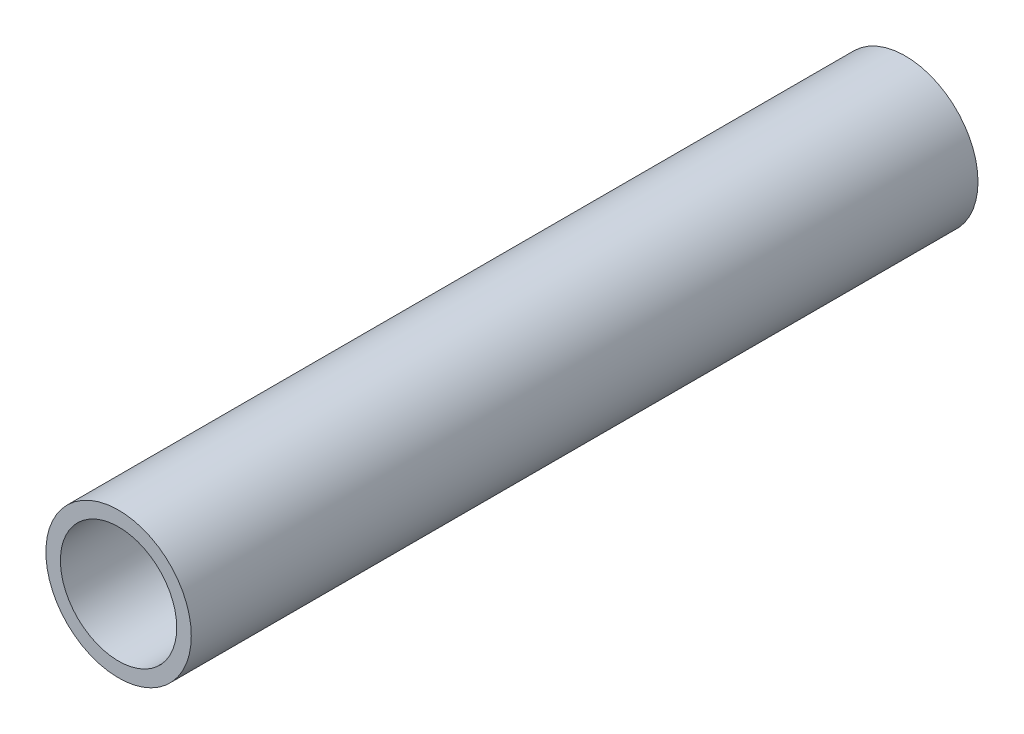
ISO-10303-21;
HEADER;
FILE_DESCRIPTION(('STEP AP214'),'2;1');
FILE_NAME('part.step','',(''),(''),'','','');
FILE_SCHEMA(('AUTOMOTIVE_DESIGN { 1 0 10303 214 1 1 1 1 }'));
ENDSEC;
DATA;
#1=APPLICATION_CONTEXT('core data for automotive mechanical design processes');
#2=APPLICATION_PROTOCOL_DEFINITION('international standard','automotive_design',2000,#1);
#3=PRODUCT_CONTEXT('',#1,'mechanical');
#4=PRODUCT('Part','Part','',(#3));
#5=PRODUCT_RELATED_PRODUCT_CATEGORY('part','',(#4));
#6=PRODUCT_DEFINITION_FORMATION('','',#4);
#7=PRODUCT_DEFINITION_CONTEXT('part definition',#1,'design');
#8=PRODUCT_DEFINITION('design','',#6,#7);
#9=PRODUCT_DEFINITION_SHAPE('','',#8);
#10=(LENGTH_UNIT() NAMED_UNIT(*) SI_UNIT(.MILLI.,.METRE.));
#11=(NAMED_UNIT(*) PLANE_ANGLE_UNIT() SI_UNIT($,.RADIAN.));
#12=(NAMED_UNIT(*) SI_UNIT($,.STERADIAN.) SOLID_ANGLE_UNIT());
#13=UNCERTAINTY_MEASURE_WITH_UNIT(LENGTH_MEASURE(1.E-05),#10,'distance_accuracy_value','');
#14=(GEOMETRIC_REPRESENTATION_CONTEXT(3) GLOBAL_UNCERTAINTY_ASSIGNED_CONTEXT((#13)) GLOBAL_UNIT_ASSIGNED_CONTEXT((#10,
#11,#12)) REPRESENTATION_CONTEXT('',''));
#15=CARTESIAN_POINT('',(0.,0.,0.));
#16=DIRECTION('',(0.,0.,1.));
#17=DIRECTION('',(1.,0.,0.));
#18=AXIS2_PLACEMENT_3D('',#15,#16,#17);
#19=CARTESIAN_POINT('',(0.,0.,13.525));
#20=DIRECTION('',(0.,0.,1.));
#21=DIRECTION('',(1.,0.,0.));
#22=AXIS2_PLACEMENT_3D('',#19,#20,#21);
#23=PLANE('',#22);
#24=CARTESIAN_POINT('',(0.,0.,13.525));
#25=DIRECTION('',(0.,0.,1.));
#26=DIRECTION('',(1.,0.,0.));
#27=AXIS2_PLACEMENT_3D('',#24,#25,#26);
#28=CIRCLE('',#27,1.25);
#29=CARTESIAN_POINT('',(1.25,0.,13.525));
#30=VERTEX_POINT('',#29);
#31=EDGE_CURVE('E10',#30,#30,#28,.T.);
#32=ORIENTED_EDGE('',*,*,#31,.T.);
#33=EDGE_LOOP('',(#32));
#34=FACE_BOUND('',#33,.T.);
#35=CARTESIAN_POINT('',(0.,0.,13.525));
#36=DIRECTION('',(0.,0.,1.));
#37=DIRECTION('',(1.,0.,0.));
#38=AXIS2_PLACEMENT_3D('',#35,#36,#37);
#39=CIRCLE('',#38,1.);
#40=CARTESIAN_POINT('',(1.,0.,13.525));
#41=VERTEX_POINT('',#40);
#42=EDGE_CURVE('E42',#41,#41,#39,.T.);
#43=ORIENTED_EDGE('',*,*,#42,.F.);
#44=EDGE_LOOP('',(#43));
#45=FACE_BOUND('',#44,.T.);
#46=ADVANCED_FACE('F31',(#34,#45),#23,.T.);
#47=CARTESIAN_POINT('',(0.,0.,0.));
#48=DIRECTION('',(0.,0.,1.));
#49=DIRECTION('',(1.,0.,0.));
#50=AXIS2_PLACEMENT_3D('',#47,#48,#49);
#51=PLANE('',#50);
#52=CARTESIAN_POINT('',(0.,0.,0.));
#53=DIRECTION('',(0.,0.,1.));
#54=DIRECTION('',(1.,0.,0.));
#55=AXIS2_PLACEMENT_3D('',#52,#53,#54);
#56=CIRCLE('',#55,1.25);
#57=CARTESIAN_POINT('',(1.25,0.,0.));
#58=VERTEX_POINT('',#57);
#59=EDGE_CURVE('E35',#58,#58,#56,.T.);
#60=ORIENTED_EDGE('',*,*,#59,.F.);
#61=EDGE_LOOP('',(#60));
#62=FACE_BOUND('',#61,.T.);
#63=CARTESIAN_POINT('',(0.,0.,0.));
#64=DIRECTION('',(0.,0.,1.));
#65=DIRECTION('',(1.,0.,0.));
#66=AXIS2_PLACEMENT_3D('',#63,#64,#65);
#67=CIRCLE('',#66,1.);
#68=CARTESIAN_POINT('',(1.,0.,0.));
#69=VERTEX_POINT('',#68);
#70=EDGE_CURVE('E44',#69,#69,#67,.T.);
#71=ORIENTED_EDGE('',*,*,#70,.T.);
#72=EDGE_LOOP('',(#71));
#73=FACE_BOUND('',#72,.T.);
#74=ADVANCED_FACE('F54',(#62,#73),#51,.F.);
#75=CARTESIAN_POINT('',(0.,0.,13.525));
#76=DIRECTION('',(0.,0.,-1.));
#77=DIRECTION('',(-1.,0.,0.));
#78=AXIS2_PLACEMENT_3D('',#75,#76,#77);
#79=CYLINDRICAL_SURFACE('',#78,1.25);
#80=ORIENTED_EDGE('',*,*,#31,.F.);
#81=EDGE_LOOP('',(#80));
#82=FACE_BOUND('',#81,.T.);
#83=ORIENTED_EDGE('',*,*,#59,.T.);
#84=EDGE_LOOP('',(#83));
#85=FACE_BOUND('',#84,.T.);
#86=ADVANCED_FACE('F33',(#82,#85),#79,.T.);
#87=CARTESIAN_POINT('',(0.,0.,13.525));
#88=DIRECTION('',(0.,0.,-1.));
#89=DIRECTION('',(-1.,0.,0.));
#90=AXIS2_PLACEMENT_3D('',#87,#88,#89);
#91=CYLINDRICAL_SURFACE('',#90,1.);
#92=ORIENTED_EDGE('',*,*,#42,.T.);
#93=EDGE_LOOP('',(#92));
#94=FACE_BOUND('',#93,.T.);
#95=ORIENTED_EDGE('',*,*,#70,.F.);
#96=EDGE_LOOP('',(#95));
#97=FACE_BOUND('',#96,.T.);
#98=ADVANCED_FACE('F50',(#94,#97),#91,.F.);
#99=CLOSED_SHELL('',(#46,#74,#86,#98));
#100=MANIFOLD_SOLID_BREP('B2',#99);
#101=ADVANCED_BREP_SHAPE_REPRESENTATION('',(#18,#100),#14);
#102=SHAPE_DEFINITION_REPRESENTATION(#9,#101);
ENDSEC;
END-ISO-10303-21;
